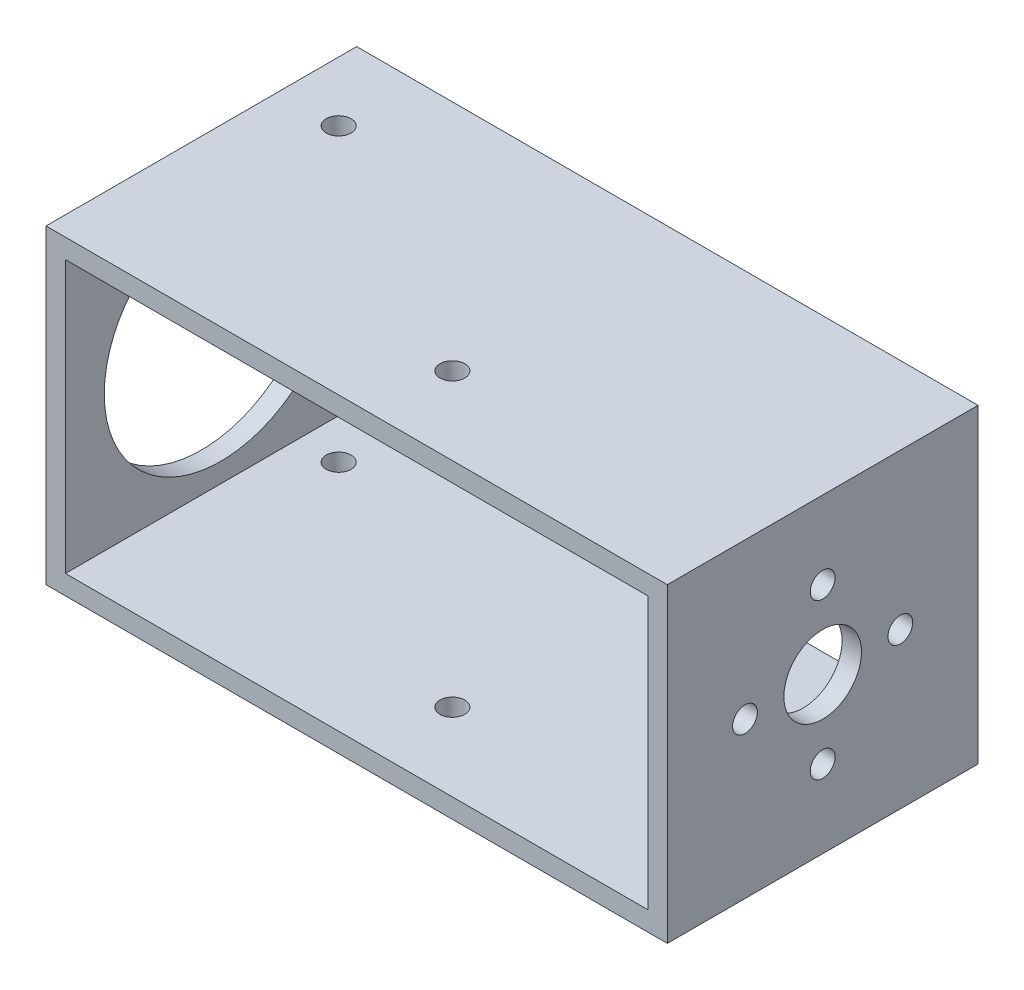
ISO-10303-21;
HEADER;
FILE_DESCRIPTION(('STEP AP214'),'2;1');
FILE_NAME('part.step','',(''),(''),'','','');
FILE_SCHEMA(('AUTOMOTIVE_DESIGN { 1 0 10303 214 1 1 1 1 }'));
ENDSEC;
DATA;
#1=APPLICATION_CONTEXT('core data for automotive mechanical design processes');
#2=APPLICATION_PROTOCOL_DEFINITION('international standard','automotive_design',2000,#1);
#3=PRODUCT_CONTEXT('',#1,'mechanical');
#4=PRODUCT('Part','Part','',(#3));
#5=PRODUCT_RELATED_PRODUCT_CATEGORY('part','',(#4));
#6=PRODUCT_DEFINITION_FORMATION('','',#4);
#7=PRODUCT_DEFINITION_CONTEXT('part definition',#1,'design');
#8=PRODUCT_DEFINITION('design','',#6,#7);
#9=PRODUCT_DEFINITION_SHAPE('','',#8);
#10=(LENGTH_UNIT() NAMED_UNIT(*) SI_UNIT(.MILLI.,.METRE.));
#11=(NAMED_UNIT(*) PLANE_ANGLE_UNIT() SI_UNIT($,.RADIAN.));
#12=(NAMED_UNIT(*) SI_UNIT($,.STERADIAN.) SOLID_ANGLE_UNIT());
#13=UNCERTAINTY_MEASURE_WITH_UNIT(LENGTH_MEASURE(1.E-05),#10,'distance_accuracy_value','');
#14=(GEOMETRIC_REPRESENTATION_CONTEXT(3) GLOBAL_UNCERTAINTY_ASSIGNED_CONTEXT((#13)) GLOBAL_UNIT_ASSIGNED_CONTEXT((#10,
#11,#12)) REPRESENTATION_CONTEXT('',''));
#15=CARTESIAN_POINT('',(0.,0.,0.));
#16=DIRECTION('',(0.,0.,1.));
#17=DIRECTION('',(1.,0.,0.));
#18=AXIS2_PLACEMENT_3D('',#15,#16,#17);
#19=CARTESIAN_POINT('',(0.,0.,20.));
#20=DIRECTION('',(0.,0.,-1.));
#21=DIRECTION('',(-1.,0.,0.));
#22=AXIS2_PLACEMENT_3D('',#19,#20,#21);
#23=PLANE('',#22);
#24=DIRECTION('',(0.,1.,0.));
#25=VECTOR('',#24,1.);
#26=CARTESIAN_POINT('',(40.,-20.,20.));
#27=LINE('',#26,#25);
#28=CARTESIAN_POINT('',(40.,-20.,20.));
#29=VERTEX_POINT('',#28);
#30=CARTESIAN_POINT('',(40.,20.,20.));
#31=VERTEX_POINT('',#30);
#32=EDGE_CURVE('E138',#29,#31,#27,.T.);
#33=ORIENTED_EDGE('',*,*,#32,.T.);
#34=DIRECTION('',(-1.,0.,0.));
#35=VECTOR('',#34,1.);
#36=CARTESIAN_POINT('',(-40.,20.,20.));
#37=LINE('',#36,#35);
#38=CARTESIAN_POINT('',(-40.,20.,20.));
#39=VERTEX_POINT('',#38);
#40=EDGE_CURVE('E141',#31,#39,#37,.T.);
#41=ORIENTED_EDGE('',*,*,#40,.T.);
#42=DIRECTION('',(0.,-1.,0.));
#43=VECTOR('',#42,1.);
#44=CARTESIAN_POINT('',(-40.,-20.,20.));
#45=LINE('',#44,#43);
#46=CARTESIAN_POINT('',(-40.,-20.,20.));
#47=VERTEX_POINT('',#46);
#48=EDGE_CURVE('E144',#39,#47,#45,.T.);
#49=ORIENTED_EDGE('',*,*,#48,.T.);
#50=DIRECTION('',(1.,0.,0.));
#51=VECTOR('',#50,1.);
#52=CARTESIAN_POINT('',(-40.,-20.,20.));
#53=LINE('',#52,#51);
#54=EDGE_CURVE('E146',#47,#29,#53,.T.);
#55=ORIENTED_EDGE('',*,*,#54,.T.);
#56=EDGE_LOOP('',(#33,#41,#49,#55));
#57=FACE_BOUND('',#56,.T.);
#58=DIRECTION('',(0.,1.,0.));
#59=VECTOR('',#58,1.);
#60=CARTESIAN_POINT('',(37.5,-17.5,20.));
#61=LINE('',#60,#59);
#62=CARTESIAN_POINT('',(37.5,-17.5,20.));
#63=VERTEX_POINT('',#62);
#64=CARTESIAN_POINT('',(37.5,17.5,20.));
#65=VERTEX_POINT('',#64);
#66=EDGE_CURVE('E100',#63,#65,#61,.T.);
#67=ORIENTED_EDGE('',*,*,#66,.F.);
#68=DIRECTION('',(1.,0.,0.));
#69=VECTOR('',#68,1.);
#70=CARTESIAN_POINT('',(-37.5,-17.5,20.));
#71=LINE('',#70,#69);
#72=CARTESIAN_POINT('',(-37.5,-17.5,20.));
#73=VERTEX_POINT('',#72);
#74=EDGE_CURVE('E122',#73,#63,#71,.T.);
#75=ORIENTED_EDGE('',*,*,#74,.F.);
#76=DIRECTION('',(0.,-1.,0.));
#77=VECTOR('',#76,1.);
#78=CARTESIAN_POINT('',(-37.5,-17.5,20.));
#79=LINE('',#78,#77);
#80=CARTESIAN_POINT('',(-37.5,17.5,20.));
#81=VERTEX_POINT('',#80);
#82=EDGE_CURVE('E120',#81,#73,#79,.T.);
#83=ORIENTED_EDGE('',*,*,#82,.F.);
#84=DIRECTION('',(-1.,0.,0.));
#85=VECTOR('',#84,1.);
#86=CARTESIAN_POINT('',(-37.5,17.5,20.));
#87=LINE('',#86,#85);
#88=EDGE_CURVE('E108',#65,#81,#87,.T.);
#89=ORIENTED_EDGE('',*,*,#88,.F.);
#90=EDGE_LOOP('',(#67,#75,#83,#89));
#91=FACE_BOUND('',#90,.T.);
#92=ADVANCED_FACE('F33',(#57,#91),#23,.F.);
#93=CARTESIAN_POINT('',(0.,0.,-20.));
#94=DIRECTION('',(0.,0.,-1.));
#95=DIRECTION('',(-1.,0.,0.));
#96=AXIS2_PLACEMENT_3D('',#93,#94,#95);
#97=PLANE('',#96);
#98=DIRECTION('',(0.,1.,0.));
#99=VECTOR('',#98,1.);
#100=CARTESIAN_POINT('',(40.,-20.,-20.));
#101=LINE('',#100,#99);
#102=CARTESIAN_POINT('',(40.,-20.,-20.));
#103=VERTEX_POINT('',#102);
#104=CARTESIAN_POINT('',(40.,20.,-20.));
#105=VERTEX_POINT('',#104);
#106=EDGE_CURVE('E116',#103,#105,#101,.T.);
#107=ORIENTED_EDGE('',*,*,#106,.F.);
#108=DIRECTION('',(1.,0.,0.));
#109=VECTOR('',#108,1.);
#110=CARTESIAN_POINT('',(-40.,-20.,-20.));
#111=LINE('',#110,#109);
#112=CARTESIAN_POINT('',(-40.,-20.,-20.));
#113=VERTEX_POINT('',#112);
#114=EDGE_CURVE('E142',#113,#103,#111,.T.);
#115=ORIENTED_EDGE('',*,*,#114,.F.);
#116=DIRECTION('',(0.,-1.,0.));
#117=VECTOR('',#116,1.);
#118=CARTESIAN_POINT('',(-40.,-20.,-20.));
#119=LINE('',#118,#117);
#120=CARTESIAN_POINT('',(-40.,20.,-20.));
#121=VERTEX_POINT('',#120);
#122=EDGE_CURVE('E153',#121,#113,#119,.T.);
#123=ORIENTED_EDGE('',*,*,#122,.F.);
#124=DIRECTION('',(-1.,0.,0.));
#125=VECTOR('',#124,1.);
#126=CARTESIAN_POINT('',(-40.,20.,-20.));
#127=LINE('',#126,#125);
#128=EDGE_CURVE('E151',#105,#121,#127,.T.);
#129=ORIENTED_EDGE('',*,*,#128,.F.);
#130=EDGE_LOOP('',(#107,#115,#123,#129));
#131=FACE_BOUND('',#130,.T.);
#132=DIRECTION('',(1.,0.,0.));
#133=VECTOR('',#132,1.);
#134=CARTESIAN_POINT('',(-37.5,-17.5,-20.));
#135=LINE('',#134,#133);
#136=CARTESIAN_POINT('',(-37.5,-17.5,-20.));
#137=VERTEX_POINT('',#136);
#138=CARTESIAN_POINT('',(37.5,-17.5,-20.));
#139=VERTEX_POINT('',#138);
#140=EDGE_CURVE('E109',#137,#139,#135,.T.);
#141=ORIENTED_EDGE('',*,*,#140,.T.);
#142=DIRECTION('',(0.,1.,0.));
#143=VECTOR('',#142,1.);
#144=CARTESIAN_POINT('',(37.5,-17.5,-20.));
#145=LINE('',#144,#143);
#146=CARTESIAN_POINT('',(37.5,17.5,-20.));
#147=VERTEX_POINT('',#146);
#148=EDGE_CURVE('E58',#139,#147,#145,.T.);
#149=ORIENTED_EDGE('',*,*,#148,.T.);
#150=DIRECTION('',(-1.,0.,0.));
#151=VECTOR('',#150,1.);
#152=CARTESIAN_POINT('',(-37.5,17.5,-20.));
#153=LINE('',#152,#151);
#154=CARTESIAN_POINT('',(-37.5,17.5,-20.));
#155=VERTEX_POINT('',#154);
#156=EDGE_CURVE('E115',#147,#155,#153,.T.);
#157=ORIENTED_EDGE('',*,*,#156,.T.);
#158=DIRECTION('',(0.,-1.,0.));
#159=VECTOR('',#158,1.);
#160=CARTESIAN_POINT('',(-37.5,-17.5,-20.));
#161=LINE('',#160,#159);
#162=EDGE_CURVE('E130',#155,#137,#161,.T.);
#163=ORIENTED_EDGE('',*,*,#162,.T.);
#164=EDGE_LOOP('',(#141,#149,#157,#163));
#165=FACE_BOUND('',#164,.T.);
#166=ADVANCED_FACE('F227',(#131,#165),#97,.T.);
#167=CARTESIAN_POINT('',(40.,-20.,20.));
#168=DIRECTION('',(-1.,0.,0.));
#169=DIRECTION('',(0.,0.,1.));
#170=AXIS2_PLACEMENT_3D('',#167,#168,#169);
#171=PLANE('',#170);
#172=CARTESIAN_POINT('',(40.,10.,0.));
#173=DIRECTION('',(1.,0.,0.));
#174=DIRECTION('',(0.,0.,-1.));
#175=AXIS2_PLACEMENT_3D('',#172,#173,#174);
#176=CIRCLE('',#175,1.6);
#177=CARTESIAN_POINT('',(40.,10.,-1.6));
#178=VERTEX_POINT('',#177);
#179=EDGE_CURVE('E128',#178,#178,#176,.T.);
#180=ORIENTED_EDGE('',*,*,#179,.F.);
#181=EDGE_LOOP('',(#180));
#182=FACE_BOUND('',#181,.T.);
#183=CARTESIAN_POINT('',(40.,0.,0.));
#184=DIRECTION('',(1.,0.,0.));
#185=DIRECTION('',(0.,0.,-1.));
#186=AXIS2_PLACEMENT_3D('',#183,#184,#185);
#187=CIRCLE('',#186,5.);
#188=CARTESIAN_POINT('',(40.,0.,-5.));
#189=VERTEX_POINT('',#188);
#190=EDGE_CURVE('E204',#189,#189,#187,.T.);
#191=ORIENTED_EDGE('',*,*,#190,.F.);
#192=EDGE_LOOP('',(#191));
#193=FACE_BOUND('',#192,.T.);
#194=CARTESIAN_POINT('',(40.,0.,10.));
#195=DIRECTION('',(1.,0.,0.));
#196=DIRECTION('',(0.,0.,-1.));
#197=AXIS2_PLACEMENT_3D('',#194,#195,#196);
#198=CIRCLE('',#197,1.6);
#199=CARTESIAN_POINT('',(40.,0.,8.4));
#200=VERTEX_POINT('',#199);
#201=EDGE_CURVE('E203',#200,#200,#198,.T.);
#202=ORIENTED_EDGE('',*,*,#201,.F.);
#203=EDGE_LOOP('',(#202));
#204=FACE_BOUND('',#203,.T.);
#205=CARTESIAN_POINT('',(40.,-10.,0.));
#206=DIRECTION('',(1.,0.,0.));
#207=DIRECTION('',(0.,0.,-1.));
#208=AXIS2_PLACEMENT_3D('',#205,#206,#207);
#209=CIRCLE('',#208,1.6);
#210=CARTESIAN_POINT('',(40.,-10.,-1.6));
#211=VERTEX_POINT('',#210);
#212=EDGE_CURVE('E215',#211,#211,#209,.T.);
#213=ORIENTED_EDGE('',*,*,#212,.F.);
#214=EDGE_LOOP('',(#213));
#215=FACE_BOUND('',#214,.T.);
#216=CARTESIAN_POINT('',(40.,0.,-10.));
#217=DIRECTION('',(1.,0.,0.));
#218=DIRECTION('',(0.,0.,-1.));
#219=AXIS2_PLACEMENT_3D('',#216,#217,#218);
#220=CIRCLE('',#219,1.6);
#221=CARTESIAN_POINT('',(40.,0.,-11.6));
#222=VERTEX_POINT('',#221);
#223=EDGE_CURVE('E197',#222,#222,#220,.T.);
#224=ORIENTED_EDGE('',*,*,#223,.F.);
#225=EDGE_LOOP('',(#224));
#226=FACE_BOUND('',#225,.T.);
#227=ORIENTED_EDGE('',*,*,#106,.T.);
#228=DIRECTION('',(0.,0.,-1.));
#229=VECTOR('',#228,1.);
#230=CARTESIAN_POINT('',(40.,20.,20.));
#231=LINE('',#230,#229);
#232=EDGE_CURVE('E11',#31,#105,#231,.T.);
#233=ORIENTED_EDGE('',*,*,#232,.F.);
#234=ORIENTED_EDGE('',*,*,#32,.F.);
#235=DIRECTION('',(0.,0.,-1.));
#236=VECTOR('',#235,1.);
#237=CARTESIAN_POINT('',(40.,-20.,20.));
#238=LINE('',#237,#236);
#239=EDGE_CURVE('E148',#29,#103,#238,.T.);
#240=ORIENTED_EDGE('',*,*,#239,.T.);
#241=EDGE_LOOP('',(#227,#233,#234,#240));
#242=FACE_BOUND('',#241,.T.);
#243=ADVANCED_FACE('F35',(#182,#193,#204,#215,#226,#242),#171,.F.);
#244=CARTESIAN_POINT('',(-40.,20.,20.));
#245=DIRECTION('',(0.,-1.,0.));
#246=DIRECTION('',(0.,0.,-1.));
#247=AXIS2_PLACEMENT_3D('',#244,#245,#246);
#248=PLANE('',#247);
#249=CARTESIAN_POINT('',(-32.3205080756889,20.,-9.9999999999999));
#250=DIRECTION('',(0.,-1.,0.));
#251=DIRECTION('',(0.,0.,-1.));
#252=AXIS2_PLACEMENT_3D('',#249,#250,#251);
#253=CIRCLE('',#252,1.6);
#254=CARTESIAN_POINT('',(-32.3205080756889,20.,-11.5999999999999));
#255=VERTEX_POINT('',#254);
#256=EDGE_CURVE('E165',#255,#255,#253,.T.);
#257=ORIENTED_EDGE('',*,*,#256,.T.);
#258=EDGE_LOOP('',(#257));
#259=FACE_BOUND('',#258,.T.);
#260=CARTESIAN_POINT('',(2.32050807568877,20.,9.9999999999999));
#261=DIRECTION('',(0.,-1.,0.));
#262=DIRECTION('',(0.,0.,-1.));
#263=AXIS2_PLACEMENT_3D('',#260,#261,#262);
#264=CIRCLE('',#263,1.6);
#265=CARTESIAN_POINT('',(2.32050807568877,20.,8.3999999999999));
#266=VERTEX_POINT('',#265);
#267=EDGE_CURVE('E176',#266,#266,#264,.T.);
#268=ORIENTED_EDGE('',*,*,#267,.T.);
#269=EDGE_LOOP('',(#268));
#270=FACE_BOUND('',#269,.T.);
#271=ORIENTED_EDGE('',*,*,#128,.T.);
#272=DIRECTION('',(0.,0.,-1.));
#273=VECTOR('',#272,1.);
#274=CARTESIAN_POINT('',(-40.,20.,20.));
#275=LINE('',#274,#273);
#276=EDGE_CURVE('E42',#39,#121,#275,.T.);
#277=ORIENTED_EDGE('',*,*,#276,.F.);
#278=ORIENTED_EDGE('',*,*,#40,.F.);
#279=ORIENTED_EDGE('',*,*,#232,.T.);
#280=EDGE_LOOP('',(#271,#277,#278,#279));
#281=FACE_BOUND('',#280,.T.);
#282=ADVANCED_FACE('F226',(#259,#270,#281),#248,.F.);
#283=CARTESIAN_POINT('',(-40.,-20.,20.));
#284=DIRECTION('',(1.,0.,0.));
#285=DIRECTION('',(0.,0.,-1.));
#286=AXIS2_PLACEMENT_3D('',#283,#284,#285);
#287=PLANE('',#286);
#288=CARTESIAN_POINT('',(-40.,0.,0.));
#289=DIRECTION('',(-1.,0.,0.));
#290=DIRECTION('',(0.,0.,1.));
#291=AXIS2_PLACEMENT_3D('',#288,#289,#290);
#292=CIRCLE('',#291,15.);
#293=CARTESIAN_POINT('',(-40.,0.,15.));
#294=VERTEX_POINT('',#293);
#295=EDGE_CURVE('E188',#294,#294,#292,.T.);
#296=ORIENTED_EDGE('',*,*,#295,.F.);
#297=EDGE_LOOP('',(#296));
#298=FACE_BOUND('',#297,.T.);
#299=ORIENTED_EDGE('',*,*,#122,.T.);
#300=DIRECTION('',(0.,0.,-1.));
#301=VECTOR('',#300,1.);
#302=CARTESIAN_POINT('',(-40.,-20.,20.));
#303=LINE('',#302,#301);
#304=EDGE_CURVE('E158',#47,#113,#303,.T.);
#305=ORIENTED_EDGE('',*,*,#304,.F.);
#306=ORIENTED_EDGE('',*,*,#48,.F.);
#307=ORIENTED_EDGE('',*,*,#276,.T.);
#308=EDGE_LOOP('',(#299,#305,#306,#307));
#309=FACE_BOUND('',#308,.T.);
#310=ADVANCED_FACE('F248',(#298,#309),#287,.F.);
#311=CARTESIAN_POINT('',(-40.,-20.,20.));
#312=DIRECTION('',(0.,1.,0.));
#313=DIRECTION('',(0.,0.,1.));
#314=AXIS2_PLACEMENT_3D('',#311,#312,#313);
#315=PLANE('',#314);
#316=CARTESIAN_POINT('',(-32.3205080756889,-20.,-9.9999999999999));
#317=DIRECTION('',(0.,-1.,0.));
#318=DIRECTION('',(0.,0.,-1.));
#319=AXIS2_PLACEMENT_3D('',#316,#317,#318);
#320=CIRCLE('',#319,1.6);
#321=CARTESIAN_POINT('',(-32.3205080756889,-20.,-11.5999999999999));
#322=VERTEX_POINT('',#321);
#323=EDGE_CURVE('E171',#322,#322,#320,.T.);
#324=ORIENTED_EDGE('',*,*,#323,.F.);
#325=EDGE_LOOP('',(#324));
#326=FACE_BOUND('',#325,.T.);
#327=CARTESIAN_POINT('',(2.32050807568877,-20.,9.9999999999999));
#328=DIRECTION('',(0.,-1.,0.));
#329=DIRECTION('',(0.,0.,-1.));
#330=AXIS2_PLACEMENT_3D('',#327,#328,#329);
#331=CIRCLE('',#330,1.6);
#332=CARTESIAN_POINT('',(2.32050807568877,-20.,8.3999999999999));
#333=VERTEX_POINT('',#332);
#334=EDGE_CURVE('E181',#333,#333,#331,.T.);
#335=ORIENTED_EDGE('',*,*,#334,.F.);
#336=EDGE_LOOP('',(#335));
#337=FACE_BOUND('',#336,.T.);
#338=ORIENTED_EDGE('',*,*,#114,.T.);
#339=ORIENTED_EDGE('',*,*,#239,.F.);
#340=ORIENTED_EDGE('',*,*,#54,.F.);
#341=ORIENTED_EDGE('',*,*,#304,.T.);
#342=EDGE_LOOP('',(#338,#339,#340,#341));
#343=FACE_BOUND('',#342,.T.);
#344=ADVANCED_FACE('F246',(#326,#337,#343),#315,.F.);
#345=CARTESIAN_POINT('',(37.5,-17.5,20.));
#346=DIRECTION('',(-1.,0.,0.));
#347=DIRECTION('',(0.,0.,1.));
#348=AXIS2_PLACEMENT_3D('',#345,#346,#347);
#349=PLANE('',#348);
#350=CARTESIAN_POINT('',(37.5,10.,0.));
#351=DIRECTION('',(-1.,0.,0.));
#352=DIRECTION('',(0.,0.,1.));
#353=AXIS2_PLACEMENT_3D('',#350,#351,#352);
#354=CIRCLE('',#353,1.6);
#355=CARTESIAN_POINT('',(37.5,10.,1.6));
#356=VERTEX_POINT('',#355);
#357=EDGE_CURVE('E194',#356,#356,#354,.F.);
#358=ORIENTED_EDGE('',*,*,#357,.T.);
#359=EDGE_LOOP('',(#358));
#360=FACE_BOUND('',#359,.T.);
#361=CARTESIAN_POINT('',(37.5,0.,0.));
#362=DIRECTION('',(-1.,0.,0.));
#363=DIRECTION('',(0.,0.,1.));
#364=AXIS2_PLACEMENT_3D('',#361,#362,#363);
#365=CIRCLE('',#364,5.);
#366=CARTESIAN_POINT('',(37.5,0.,5.));
#367=VERTEX_POINT('',#366);
#368=EDGE_CURVE('E191',#367,#367,#365,.F.);
#369=ORIENTED_EDGE('',*,*,#368,.T.);
#370=EDGE_LOOP('',(#369));
#371=FACE_BOUND('',#370,.T.);
#372=CARTESIAN_POINT('',(37.5,0.,10.));
#373=DIRECTION('',(-1.,0.,0.));
#374=DIRECTION('',(0.,0.,1.));
#375=AXIS2_PLACEMENT_3D('',#372,#373,#374);
#376=CIRCLE('',#375,1.6);
#377=CARTESIAN_POINT('',(37.5,0.,11.6));
#378=VERTEX_POINT('',#377);
#379=EDGE_CURVE('E200',#378,#378,#376,.F.);
#380=ORIENTED_EDGE('',*,*,#379,.T.);
#381=EDGE_LOOP('',(#380));
#382=FACE_BOUND('',#381,.T.);
#383=CARTESIAN_POINT('',(37.5,-10.,0.));
#384=DIRECTION('',(-1.,0.,0.));
#385=DIRECTION('',(0.,0.,1.));
#386=AXIS2_PLACEMENT_3D('',#383,#384,#385);
#387=CIRCLE('',#386,1.6);
#388=CARTESIAN_POINT('',(37.5,-10.,1.6));
#389=VERTEX_POINT('',#388);
#390=EDGE_CURVE('E207',#389,#389,#387,.F.);
#391=ORIENTED_EDGE('',*,*,#390,.T.);
#392=EDGE_LOOP('',(#391));
#393=FACE_BOUND('',#392,.T.);
#394=CARTESIAN_POINT('',(37.5,0.,-10.));
#395=DIRECTION('',(-1.,0.,0.));
#396=DIRECTION('',(0.,0.,1.));
#397=AXIS2_PLACEMENT_3D('',#394,#395,#396);
#398=CIRCLE('',#397,1.6);
#399=CARTESIAN_POINT('',(37.5,0.,-8.4));
#400=VERTEX_POINT('',#399);
#401=EDGE_CURVE('E212',#400,#400,#398,.F.);
#402=ORIENTED_EDGE('',*,*,#401,.T.);
#403=EDGE_LOOP('',(#402));
#404=FACE_BOUND('',#403,.T.);
#405=ORIENTED_EDGE('',*,*,#148,.F.);
#406=DIRECTION('',(0.,0.,-1.));
#407=VECTOR('',#406,1.);
#408=CARTESIAN_POINT('',(37.5,-17.5,20.));
#409=LINE('',#408,#407);
#410=EDGE_CURVE('E104',#63,#139,#409,.T.);
#411=ORIENTED_EDGE('',*,*,#410,.F.);
#412=ORIENTED_EDGE('',*,*,#66,.T.);
#413=DIRECTION('',(0.,0.,-1.));
#414=VECTOR('',#413,1.);
#415=CARTESIAN_POINT('',(37.5,17.5,20.));
#416=LINE('',#415,#414);
#417=EDGE_CURVE('E103',#65,#147,#416,.T.);
#418=ORIENTED_EDGE('',*,*,#417,.T.);
#419=EDGE_LOOP('',(#405,#411,#412,#418));
#420=FACE_BOUND('',#419,.T.);
#421=ADVANCED_FACE('F102',(#360,#371,#382,#393,#404,#420),#349,.T.);
#422=CARTESIAN_POINT('',(-37.5,17.5,20.));
#423=DIRECTION('',(0.,-1.,0.));
#424=DIRECTION('',(0.,0.,-1.));
#425=AXIS2_PLACEMENT_3D('',#422,#423,#424);
#426=PLANE('',#425);
#427=CARTESIAN_POINT('',(-32.3205080756889,17.5,-9.9999999999999));
#428=DIRECTION('',(0.,-1.,0.));
#429=DIRECTION('',(0.,0.,-1.));
#430=AXIS2_PLACEMENT_3D('',#427,#428,#429);
#431=CIRCLE('',#430,1.6);
#432=CARTESIAN_POINT('',(-32.3205080756889,17.5,-11.5999999999999));
#433=VERTEX_POINT('',#432);
#434=EDGE_CURVE('E184',#433,#433,#431,.T.);
#435=ORIENTED_EDGE('',*,*,#434,.F.);
#436=EDGE_LOOP('',(#435));
#437=FACE_BOUND('',#436,.T.);
#438=CARTESIAN_POINT('',(2.32050807568877,17.5,9.9999999999999));
#439=DIRECTION('',(0.,-1.,0.));
#440=DIRECTION('',(0.,0.,-1.));
#441=AXIS2_PLACEMENT_3D('',#438,#439,#440);
#442=CIRCLE('',#441,1.6);
#443=CARTESIAN_POINT('',(2.32050807568877,17.5,8.3999999999999));
#444=VERTEX_POINT('',#443);
#445=EDGE_CURVE('E164',#444,#444,#442,.T.);
#446=ORIENTED_EDGE('',*,*,#445,.F.);
#447=EDGE_LOOP('',(#446));
#448=FACE_BOUND('',#447,.T.);
#449=ORIENTED_EDGE('',*,*,#156,.F.);
#450=ORIENTED_EDGE('',*,*,#417,.F.);
#451=ORIENTED_EDGE('',*,*,#88,.T.);
#452=DIRECTION('',(0.,0.,-1.));
#453=VECTOR('',#452,1.);
#454=CARTESIAN_POINT('',(-37.5,17.5,20.));
#455=LINE('',#454,#453);
#456=EDGE_CURVE('E117',#81,#155,#455,.T.);
#457=ORIENTED_EDGE('',*,*,#456,.T.);
#458=EDGE_LOOP('',(#449,#450,#451,#457));
#459=FACE_BOUND('',#458,.T.);
#460=ADVANCED_FACE('F112',(#437,#448,#459),#426,.T.);
#461=CARTESIAN_POINT('',(-37.5,-17.5,20.));
#462=DIRECTION('',(1.,0.,0.));
#463=DIRECTION('',(0.,0.,-1.));
#464=AXIS2_PLACEMENT_3D('',#461,#462,#463);
#465=PLANE('',#464);
#466=CARTESIAN_POINT('',(-37.5,0.,0.));
#467=DIRECTION('',(1.,0.,0.));
#468=DIRECTION('',(0.,0.,-1.));
#469=AXIS2_PLACEMENT_3D('',#466,#467,#468);
#470=CIRCLE('',#469,15.);
#471=CARTESIAN_POINT('',(-37.5,0.,-15.));
#472=VERTEX_POINT('',#471);
#473=EDGE_CURVE('E187',#472,#472,#470,.F.);
#474=ORIENTED_EDGE('',*,*,#473,.T.);
#475=EDGE_LOOP('',(#474));
#476=FACE_BOUND('',#475,.T.);
#477=ORIENTED_EDGE('',*,*,#162,.F.);
#478=ORIENTED_EDGE('',*,*,#456,.F.);
#479=ORIENTED_EDGE('',*,*,#82,.T.);
#480=DIRECTION('',(0.,0.,-1.));
#481=VECTOR('',#480,1.);
#482=CARTESIAN_POINT('',(-37.5,-17.5,20.));
#483=LINE('',#482,#481);
#484=EDGE_CURVE('E50',#73,#137,#483,.T.);
#485=ORIENTED_EDGE('',*,*,#484,.T.);
#486=EDGE_LOOP('',(#477,#478,#479,#485));
#487=FACE_BOUND('',#486,.T.);
#488=ADVANCED_FACE('F271',(#476,#487),#465,.T.);
#489=CARTESIAN_POINT('',(-37.5,-17.5,20.));
#490=DIRECTION('',(0.,1.,0.));
#491=DIRECTION('',(0.,0.,1.));
#492=AXIS2_PLACEMENT_3D('',#489,#490,#491);
#493=PLANE('',#492);
#494=CARTESIAN_POINT('',(-32.3205080756889,-17.5,-9.9999999999999));
#495=DIRECTION('',(0.,1.,0.));
#496=DIRECTION('',(0.,0.,1.));
#497=AXIS2_PLACEMENT_3D('',#494,#495,#496);
#498=CIRCLE('',#497,1.6);
#499=CARTESIAN_POINT('',(-32.3205080756889,-17.5,-8.3999999999999));
#500=VERTEX_POINT('',#499);
#501=EDGE_CURVE('E37',#500,#500,#498,.T.);
#502=ORIENTED_EDGE('',*,*,#501,.F.);
#503=EDGE_LOOP('',(#502));
#504=FACE_BOUND('',#503,.T.);
#505=CARTESIAN_POINT('',(2.32050807568877,-17.5,9.9999999999999));
#506=DIRECTION('',(0.,1.,0.));
#507=DIRECTION('',(0.,0.,1.));
#508=AXIS2_PLACEMENT_3D('',#505,#506,#507);
#509=CIRCLE('',#508,1.6);
#510=CARTESIAN_POINT('',(2.32050807568877,-17.5,11.5999999999999));
#511=VERTEX_POINT('',#510);
#512=EDGE_CURVE('E162',#511,#511,#509,.T.);
#513=ORIENTED_EDGE('',*,*,#512,.F.);
#514=EDGE_LOOP('',(#513));
#515=FACE_BOUND('',#514,.T.);
#516=ORIENTED_EDGE('',*,*,#140,.F.);
#517=ORIENTED_EDGE('',*,*,#484,.F.);
#518=ORIENTED_EDGE('',*,*,#74,.T.);
#519=ORIENTED_EDGE('',*,*,#410,.T.);
#520=EDGE_LOOP('',(#516,#517,#518,#519));
#521=FACE_BOUND('',#520,.T.);
#522=ADVANCED_FACE('F275',(#504,#515,#521),#493,.T.);
#523=CARTESIAN_POINT('',(-40.0010000000001,0.,-10.));
#524=DIRECTION('',(1.,0.,0.));
#525=DIRECTION('',(0.,0.,-1.));
#526=AXIS2_PLACEMENT_3D('',#523,#524,#525);
#527=CYLINDRICAL_SURFACE('',#526,1.6);
#528=ORIENTED_EDGE('',*,*,#401,.F.);
#529=EDGE_LOOP('',(#528));
#530=FACE_BOUND('',#529,.T.);
#531=ORIENTED_EDGE('',*,*,#223,.T.);
#532=EDGE_LOOP('',(#531));
#533=FACE_BOUND('',#532,.T.);
#534=ADVANCED_FACE('F279',(#530,#533),#527,.F.);
#535=CARTESIAN_POINT('',(-40.0010000000001,-10.,0.));
#536=DIRECTION('',(1.,0.,0.));
#537=DIRECTION('',(0.,0.,-1.));
#538=AXIS2_PLACEMENT_3D('',#535,#536,#537);
#539=CYLINDRICAL_SURFACE('',#538,1.6);
#540=ORIENTED_EDGE('',*,*,#390,.F.);
#541=EDGE_LOOP('',(#540));
#542=FACE_BOUND('',#541,.T.);
#543=ORIENTED_EDGE('',*,*,#212,.T.);
#544=EDGE_LOOP('',(#543));
#545=FACE_BOUND('',#544,.T.);
#546=ADVANCED_FACE('F222',(#542,#545),#539,.F.);
#547=CARTESIAN_POINT('',(-40.0010000000001,0.,10.));
#548=DIRECTION('',(1.,0.,0.));
#549=DIRECTION('',(0.,0.,-1.));
#550=AXIS2_PLACEMENT_3D('',#547,#548,#549);
#551=CYLINDRICAL_SURFACE('',#550,1.6);
#552=ORIENTED_EDGE('',*,*,#379,.F.);
#553=EDGE_LOOP('',(#552));
#554=FACE_BOUND('',#553,.T.);
#555=ORIENTED_EDGE('',*,*,#201,.T.);
#556=EDGE_LOOP('',(#555));
#557=FACE_BOUND('',#556,.T.);
#558=ADVANCED_FACE('F283',(#554,#557),#551,.F.);
#559=CARTESIAN_POINT('',(-40.0010000000001,0.,0.));
#560=DIRECTION('',(1.,0.,0.));
#561=DIRECTION('',(0.,0.,-1.));
#562=AXIS2_PLACEMENT_3D('',#559,#560,#561);
#563=CYLINDRICAL_SURFACE('',#562,5.);
#564=ORIENTED_EDGE('',*,*,#368,.F.);
#565=EDGE_LOOP('',(#564));
#566=FACE_BOUND('',#565,.T.);
#567=ORIENTED_EDGE('',*,*,#190,.T.);
#568=EDGE_LOOP('',(#567));
#569=FACE_BOUND('',#568,.T.);
#570=ADVANCED_FACE('F288',(#566,#569),#563,.F.);
#571=CARTESIAN_POINT('',(-40.0010000000001,10.,0.));
#572=DIRECTION('',(1.,0.,0.));
#573=DIRECTION('',(0.,0.,-1.));
#574=AXIS2_PLACEMENT_3D('',#571,#572,#573);
#575=CYLINDRICAL_SURFACE('',#574,1.6);
#576=ORIENTED_EDGE('',*,*,#357,.F.);
#577=EDGE_LOOP('',(#576));
#578=FACE_BOUND('',#577,.T.);
#579=ORIENTED_EDGE('',*,*,#179,.T.);
#580=EDGE_LOOP('',(#579));
#581=FACE_BOUND('',#580,.T.);
#582=ADVANCED_FACE('F291',(#578,#581),#575,.F.);
#583=CARTESIAN_POINT('',(40.001,0.,0.));
#584=DIRECTION('',(-1.,0.,0.));
#585=DIRECTION('',(0.,0.,1.));
#586=AXIS2_PLACEMENT_3D('',#583,#584,#585);
#587=CYLINDRICAL_SURFACE('',#586,15.);
#588=ORIENTED_EDGE('',*,*,#473,.F.);
#589=EDGE_LOOP('',(#588));
#590=FACE_BOUND('',#589,.T.);
#591=ORIENTED_EDGE('',*,*,#295,.T.);
#592=EDGE_LOOP('',(#591));
#593=FACE_BOUND('',#592,.T.);
#594=ADVANCED_FACE('F298',(#590,#593),#587,.F.);
#595=CARTESIAN_POINT('',(2.32050807568877,20.,9.9999999999999));
#596=DIRECTION('',(0.,-1.,0.));
#597=DIRECTION('',(0.,0.,-1.));
#598=AXIS2_PLACEMENT_3D('',#595,#596,#597);
#599=CYLINDRICAL_SURFACE('',#598,1.6);
#600=ORIENTED_EDGE('',*,*,#512,.T.);
#601=EDGE_LOOP('',(#600));
#602=FACE_BOUND('',#601,.T.);
#603=ORIENTED_EDGE('',*,*,#334,.T.);
#604=EDGE_LOOP('',(#603));
#605=FACE_BOUND('',#604,.T.);
#606=ADVANCED_FACE('F302',(#602,#605),#599,.F.);
#607=CARTESIAN_POINT('',(-32.3205080756889,20.,-9.9999999999999));
#608=DIRECTION('',(0.,-1.,0.));
#609=DIRECTION('',(0.,0.,-1.));
#610=AXIS2_PLACEMENT_3D('',#607,#608,#609);
#611=CYLINDRICAL_SURFACE('',#610,1.6);
#612=ORIENTED_EDGE('',*,*,#501,.T.);
#613=EDGE_LOOP('',(#612));
#614=FACE_BOUND('',#613,.T.);
#615=ORIENTED_EDGE('',*,*,#323,.T.);
#616=EDGE_LOOP('',(#615));
#617=FACE_BOUND('',#616,.T.);
#618=ADVANCED_FACE('F306',(#614,#617),#611,.F.);
#619=ORIENTED_EDGE('',*,*,#445,.T.);
#620=EDGE_LOOP('',(#619));
#621=FACE_BOUND('',#620,.T.);
#622=ORIENTED_EDGE('',*,*,#267,.F.);
#623=EDGE_LOOP('',(#622));
#624=FACE_BOUND('',#623,.T.);
#625=ADVANCED_FACE('F307',(#621,#624),#599,.F.);
#626=ORIENTED_EDGE('',*,*,#434,.T.);
#627=EDGE_LOOP('',(#626));
#628=FACE_BOUND('',#627,.T.);
#629=ORIENTED_EDGE('',*,*,#256,.F.);
#630=EDGE_LOOP('',(#629));
#631=FACE_BOUND('',#630,.T.);
#632=ADVANCED_FACE('F310',(#628,#631),#611,.F.);
#633=CLOSED_SHELL('',(#92,#166,#243,#282,#310,#344,#421,#460,#488,#522,#534,#546,#558,#570,#582,
#594,#606,#618,#625,#632));
#634=MANIFOLD_SOLID_BREP('B2',#633);
#635=ADVANCED_BREP_SHAPE_REPRESENTATION('',(#18,#634),#14);
#636=SHAPE_DEFINITION_REPRESENTATION(#9,#635);
ENDSEC;
END-ISO-10303-21;
